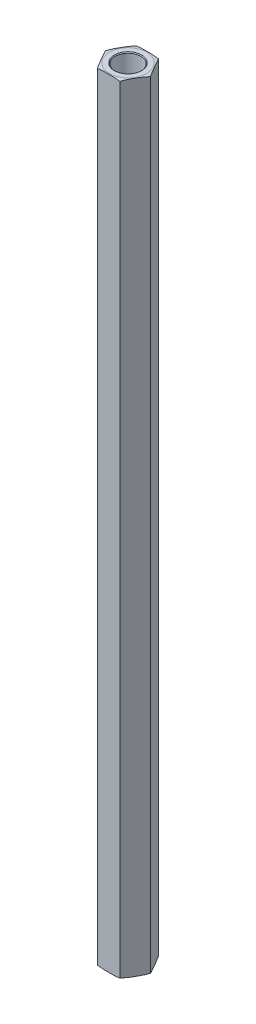
ISO-10303-21;
HEADER;
FILE_DESCRIPTION(('STEP AP214'),'2;1');
FILE_NAME('part.step','',(''),(''),'','','');
FILE_SCHEMA(('AUTOMOTIVE_DESIGN { 1 0 10303 214 1 1 1 1 }'));
ENDSEC;
DATA;
#1=APPLICATION_CONTEXT('core data for automotive mechanical design processes');
#2=APPLICATION_PROTOCOL_DEFINITION('international standard','automotive_design',2000,#1);
#3=PRODUCT_CONTEXT('',#1,'mechanical');
#4=PRODUCT('Part','Part','',(#3));
#5=PRODUCT_RELATED_PRODUCT_CATEGORY('part','',(#4));
#6=PRODUCT_DEFINITION_FORMATION('','',#4);
#7=PRODUCT_DEFINITION_CONTEXT('part definition',#1,'design');
#8=PRODUCT_DEFINITION('design','',#6,#7);
#9=PRODUCT_DEFINITION_SHAPE('','',#8);
#10=(LENGTH_UNIT() NAMED_UNIT(*) SI_UNIT(.MILLI.,.METRE.));
#11=(NAMED_UNIT(*) PLANE_ANGLE_UNIT() SI_UNIT($,.RADIAN.));
#12=(NAMED_UNIT(*) SI_UNIT($,.STERADIAN.) SOLID_ANGLE_UNIT());
#13=UNCERTAINTY_MEASURE_WITH_UNIT(LENGTH_MEASURE(1.E-05),#10,'distance_accuracy_value','');
#14=(GEOMETRIC_REPRESENTATION_CONTEXT(3) GLOBAL_UNCERTAINTY_ASSIGNED_CONTEXT((#13)) GLOBAL_UNIT_ASSIGNED_CONTEXT((#10,
#11,#12)) REPRESENTATION_CONTEXT('',''));
#15=CARTESIAN_POINT('',(0.,0.,0.));
#16=DIRECTION('',(0.,0.,1.));
#17=DIRECTION('',(1.,0.,0.));
#18=AXIS2_PLACEMENT_3D('',#15,#16,#17);
#19=CARTESIAN_POINT('',(0.,50.8,0.));
#20=DIRECTION('',(0.,1.,0.));
#21=DIRECTION('',(0.,0.,1.));
#22=AXIS2_PLACEMENT_3D('',#19,#20,#21);
#23=PLANE('',#22);
#24=CARTESIAN_POINT('',(0.,50.8,0.));
#25=DIRECTION('',(0.,1.,0.));
#26=DIRECTION('',(0.,0.,1.));
#27=AXIS2_PLACEMENT_3D('',#24,#25,#26);
#28=CIRCLE('',#27,2.0955);
#29=CARTESIAN_POINT('',(0.,50.8,2.0955));
#30=VERTEX_POINT('',#29);
#31=EDGE_CURVE('E316',#30,#30,#28,.T.);
#32=ORIENTED_EDGE('',*,*,#31,.T.);
#33=EDGE_LOOP('',(#32));
#34=FACE_BOUND('',#33,.T.);
#35=ADVANCED_FACE('F18',(#34),#23,.T.);
#36=CARTESIAN_POINT('',(0.,-50.8,0.));
#37=DIRECTION('',(0.,-1.,0.));
#38=DIRECTION('',(0.,0.,-1.));
#39=AXIS2_PLACEMENT_3D('',#36,#37,#38);
#40=PLANE('',#39);
#41=CARTESIAN_POINT('',(0.,-50.8,0.));
#42=DIRECTION('',(0.,-1.,0.));
#43=DIRECTION('',(0.,0.,-1.));
#44=AXIS2_PLACEMENT_3D('',#41,#42,#43);
#45=CIRCLE('',#44,2.0955);
#46=CARTESIAN_POINT('',(0.,-50.8,-2.0955));
#47=VERTEX_POINT('',#46);
#48=EDGE_CURVE('E450',#47,#47,#45,.T.);
#49=ORIENTED_EDGE('',*,*,#48,.T.);
#50=EDGE_LOOP('',(#49));
#51=FACE_BOUND('',#50,.T.);
#52=ADVANCED_FACE('F421',(#51),#40,.T.);
#53=CARTESIAN_POINT('',(0.,50.8,0.));
#54=DIRECTION('',(0.,1.,0.));
#55=DIRECTION('',(0.,0.,1.));
#56=AXIS2_PLACEMENT_3D('',#53,#54,#55);
#57=CYLINDRICAL_SURFACE('',#56,2.0955);
#58=CARTESIAN_POINT('',(0.,63.3729999999559,0.));
#59=DIRECTION('',(0.,1.,0.));
#60=DIRECTION('',(0.,0.,1.));
#61=AXIS2_PLACEMENT_3D('',#58,#59,#60);
#62=CIRCLE('',#61,2.09549999993897);
#63=CARTESIAN_POINT('',(0.,63.3729999999559,2.09549999993897));
#64=VERTEX_POINT('',#63);
#65=EDGE_CURVE('E452',#64,#64,#62,.T.);
#66=ORIENTED_EDGE('',*,*,#65,.T.);
#67=EDGE_LOOP('',(#66));
#68=FACE_BOUND('',#67,.T.);
#69=ORIENTED_EDGE('',*,*,#31,.F.);
#70=EDGE_LOOP('',(#69));
#71=FACE_BOUND('',#70,.T.);
#72=ADVANCED_FACE('F411',(#68,#71),#57,.F.);
#73=CARTESIAN_POINT('',(0.,-50.8,0.));
#74=DIRECTION('',(0.,-1.,0.));
#75=DIRECTION('',(0.,0.,-1.));
#76=AXIS2_PLACEMENT_3D('',#73,#74,#75);
#77=CYLINDRICAL_SURFACE('',#76,2.0955);
#78=ORIENTED_EDGE('',*,*,#48,.F.);
#79=EDGE_LOOP('',(#78));
#80=FACE_BOUND('',#79,.T.);
#81=CARTESIAN_POINT('',(0.,-63.3730000000128,0.));
#82=DIRECTION('',(0.,-1.,0.));
#83=DIRECTION('',(0.,0.,-1.));
#84=AXIS2_PLACEMENT_3D('',#81,#82,#83);
#85=CIRCLE('',#84,2.09550000005265);
#86=CARTESIAN_POINT('',(0.,-63.3730000000128,-2.09550000005265));
#87=VERTEX_POINT('',#86);
#88=EDGE_CURVE('E160',#87,#87,#85,.T.);
#89=ORIENTED_EDGE('',*,*,#88,.T.);
#90=EDGE_LOOP('',(#89));
#91=FACE_BOUND('',#90,.T.);
#92=ADVANCED_FACE('F401',(#80,#91),#77,.F.);
#93=CARTESIAN_POINT('',(0.,63.4999999999764,0.));
#94=DIRECTION('',(0.,1.,0.));
#95=DIRECTION('',(0.,0.,1.));
#96=AXIS2_PLACEMENT_3D('',#93,#94,#95);
#97=CONICAL_SURFACE('',#96,2.22249999995938,0.785398163397448);
#98=CARTESIAN_POINT('',(0.,63.5000000000332,0.));
#99=DIRECTION('',(0.,1.,0.));
#100=DIRECTION('',(0.,0.,1.));
#101=AXIS2_PLACEMENT_3D('',#98,#99,#100);
#102=CIRCLE('',#101,2.22250000001623);
#103=CARTESIAN_POINT('',(0.,63.5000000000332,2.22250000001623));
#104=VERTEX_POINT('',#103);
#105=EDGE_CURVE('E313',#104,#104,#102,.T.);
#106=ORIENTED_EDGE('',*,*,#105,.T.);
#107=EDGE_LOOP('',(#106));
#108=FACE_BOUND('',#107,.T.);
#109=ORIENTED_EDGE('',*,*,#65,.F.);
#110=EDGE_LOOP('',(#109));
#111=FACE_BOUND('',#110,.T.);
#112=ADVANCED_FACE('F336',(#108,#111),#97,.F.);
#113=CARTESIAN_POINT('',(3.66617420935412,63.5,0.));
#114=DIRECTION('',(-0.866025403784439,0.,0.5));
#115=DIRECTION('',(0.5,0.,0.866025403784439));
#116=AXIS2_PLACEMENT_3D('',#113,#114,#115);
#117=PLANE('',#116);
#118=DIRECTION('',(0.,1.,0.));
#119=VECTOR('',#118,1.);
#120=CARTESIAN_POINT('',(1.83308710467706,63.5,-3.175));
#121=LINE('',#120,#119);
#122=CARTESIAN_POINT('',(1.83308710467706,-63.373,-3.175));
#123=VERTEX_POINT('',#122);
#124=CARTESIAN_POINT('',(1.83308710467706,63.373,-3.175));
#125=VERTEX_POINT('',#124);
#126=EDGE_CURVE('E80',#123,#125,#121,.T.);
#127=ORIENTED_EDGE('',*,*,#126,.T.);
#128=CARTESIAN_POINT('',(3.66617420935412,63.373,0.));
#129=CARTESIAN_POINT('',(3.62797961467394,63.3889014148997,-0.0661549785605575));
#130=CARTESIAN_POINT('',(3.58956810864157,63.4024886076105,-0.132685658603875));
#131=CARTESIAN_POINT('',(3.51249051795711,63.4258161979402,-0.266187961794358));
#132=CARTESIAN_POINT('',(3.47382473049846,63.4355604771397,-0.333159070187389));
#133=CARTESIAN_POINT('',(3.39641631867873,63.4519966530451,-0.46723437239238));
#134=CARTESIAN_POINT('',(3.35767399633312,63.4586945328669,-0.534338043098183));
#135=CARTESIAN_POINT('',(3.28009834620113,63.4697767572932,-0.66870301055698));
#136=CARTESIAN_POINT('',(3.24126499587771,63.474160450474,-0.735964346345267));
#137=CARTESIAN_POINT('',(3.16354065964315,63.4812403004263,-0.870586845688097));
#138=CARTESIAN_POINT('',(3.12464965374476,63.4839355237591,-0.937948043861568));
#139=CARTESIAN_POINT('',(3.04685144594593,63.4881531983714,-1.07269849250694));
#140=CARTESIAN_POINT('',(3.00794424351969,63.4896756080272,-1.14008774388955));
#141=CARTESIAN_POINT('',(2.93051517598873,63.491922705889,-1.27419882283586));
#142=CARTESIAN_POINT('',(2.89199336248934,63.4926552468181,-1.34092056101649));
#143=CARTESIAN_POINT('',(2.81494778346144,63.4935767302574,-1.47436741839139));
#144=CARTESIAN_POINT('',(2.77642401791439,63.4937656658949,-1.54109253761774));
#145=CARTESIAN_POINT('',(2.69935964431012,63.4936659966806,-1.6745719481538));
#146=CARTESIAN_POINT('',(2.66081903631821,63.4933771811766,-1.74132623935039));
#147=CARTESIAN_POINT('',(2.5837390808533,63.492221986219,-1.87483263846077));
#148=CARTESIAN_POINT('',(2.54519973341245,63.4913555970386,-1.94158474631886));
#149=CARTESIAN_POINT('',(2.46812969629771,63.4887861940656,-2.07507396634282));
#150=CARTESIAN_POINT('',(2.42959900625965,63.4870832271616,-2.14181107913942));
#151=CARTESIAN_POINT('',(2.35255651340908,63.4824387229726,-2.27525259109836));
#152=CARTESIAN_POINT('',(2.31404470975443,63.4794972471358,-2.34195699171935));
#153=CARTESIAN_POINT('',(2.25084206239945,63.4732174124749,-2.45142718811103));
#154=CARTESIAN_POINT('',(2.2261384933701,63.4703980110463,-2.49421502479815));
#155=CARTESIAN_POINT('',(2.17676945272228,63.4638696794304,-2.57972471152111));
#156=CARTESIAN_POINT('',(2.15210397034183,63.4601610809139,-2.62244658019723));
#157=CARTESIAN_POINT('',(2.10282753811696,63.4516802711497,-2.70779586442644));
#158=CARTESIAN_POINT('',(2.07821657107529,63.4469084657008,-2.75042330976602));
#159=CARTESIAN_POINT('',(2.02900094683549,63.4360987712516,-2.83566727147556));
#160=CARTESIAN_POINT('',(2.00439646085463,63.4300577313084,-2.87828349128853));
#161=CARTESIAN_POINT('',(1.95527325900933,63.4165138354161,-2.96336737271505));
#162=CARTESIAN_POINT('',(1.93075459617614,63.409010197803,-3.00583494247579));
#163=CARTESIAN_POINT('',(1.88182157373171,63.3923203507084,-3.09058942351745));
#164=CARTESIAN_POINT('',(1.85740744053269,63.3831314978033,-3.1328759426409));
#165=CARTESIAN_POINT('',(1.83308710467706,63.373,-3.175));
#166=B_SPLINE_CURVE_WITH_KNOTS('',3,(#128,#129,#130,#131,#132,#133,#134,#135,#136,#137,#138,
#139,#140,#141,#142,#143,#144,#145,#146,#147,#148,#149,#150,#151,#152,#153,#154,#155,#156,#157,
#158,#159,#160,#161,#162,#163,#164,#165),.UNSPECIFIED.,.F.,.F.,(4,2,2,2,2,2,2,2,2,2,2,2,2,2,2,2,
2,2,4),(0.,0.233977307817942,0.467717675040691,0.700996973557496,0.934341903229746,
1.16781571967239,1.40129782179824,1.63243665809669,1.86357841666616,2.09482211846293,
2.32606971471494,2.55730435147396,2.78852751694412,2.93698369265086,3.08538458004473,
3.23372892334584,3.38244598546612,3.53124274626084,3.68027493713585),.UNSPECIFIED.);
#167=CARTESIAN_POINT('',(3.66617420935412,63.373,0.));
#168=VERTEX_POINT('',#167);
#169=EDGE_CURVE('E73',#168,#125,#166,.T.);
#170=ORIENTED_EDGE('',*,*,#169,.F.);
#171=DIRECTION('',(0.,1.,0.));
#172=VECTOR('',#171,1.);
#173=CARTESIAN_POINT('',(3.66617420935412,63.5,0.));
#174=LINE('',#173,#172);
#175=CARTESIAN_POINT('',(3.66617420935412,-63.373,0.));
#176=VERTEX_POINT('',#175);
#177=EDGE_CURVE('E77',#168,#176,#174,.F.);
#178=ORIENTED_EDGE('',*,*,#177,.T.);
#179=CARTESIAN_POINT('',(1.83308710467706,-63.373,-3.17499999999999));
#180=CARTESIAN_POINT('',(1.87128169935724,-63.3889014148997,-3.10884502143943));
#181=CARTESIAN_POINT('',(1.90969320538961,-63.4024886076105,-3.04231434139611));
#182=CARTESIAN_POINT('',(1.98677079607407,-63.4258161979402,-2.90881203820563));
#183=CARTESIAN_POINT('',(2.02543658353272,-63.4355604771397,-2.8418409298126));
#184=CARTESIAN_POINT('',(2.10284499535245,-63.4519966530451,-2.70776562760761));
#185=CARTESIAN_POINT('',(2.14158731769806,-63.4586945328669,-2.6406619569018));
#186=CARTESIAN_POINT('',(2.21916296783005,-63.4697767572932,-2.50629698944301));
#187=CARTESIAN_POINT('',(2.25799631815347,-63.474160450474,-2.43903565365472));
#188=CARTESIAN_POINT('',(2.33572065438804,-63.4812403004263,-2.30441315431189));
#189=CARTESIAN_POINT('',(2.37461166028642,-63.4839355237591,-2.23705195613842));
#190=CARTESIAN_POINT('',(2.45240986808526,-63.4881531983714,-2.10230150749304));
#191=CARTESIAN_POINT('',(2.49131707051149,-63.4896756080272,-2.03491225611043));
#192=CARTESIAN_POINT('',(2.56874613804245,-63.491922705889,-1.90080117716413));
#193=CARTESIAN_POINT('',(2.60726795154184,-63.4926552468181,-1.8340794389835));
#194=CARTESIAN_POINT('',(2.68431353056975,-63.4935767302574,-1.70063258160859));
#195=CARTESIAN_POINT('',(2.72283729611679,-63.4937656658949,-1.63390746238224));
#196=CARTESIAN_POINT('',(2.79990166972106,-63.4936659966806,-1.50042805184618));
#197=CARTESIAN_POINT('',(2.83844227771297,-63.4933771811766,-1.4336737606496));
#198=CARTESIAN_POINT('',(2.91552223317789,-63.492221986219,-1.30016736153921));
#199=CARTESIAN_POINT('',(2.95406158061873,-63.4913555970386,-1.23341525368112));
#200=CARTESIAN_POINT('',(3.03113161773348,-63.4887861940656,-1.09992603365716));
#201=CARTESIAN_POINT('',(3.06966230777154,-63.4870832271616,-1.03318892086056));
#202=CARTESIAN_POINT('',(3.1467048006221,-63.4824387229726,-0.899747408901616));
#203=CARTESIAN_POINT('',(3.18521660427676,-63.4794972471358,-0.833043008280631));
#204=CARTESIAN_POINT('',(3.24841925163174,-63.4732174124749,-0.723572811888948));
#205=CARTESIAN_POINT('',(3.27312282066109,-63.4703980110463,-0.680784975201834));
#206=CARTESIAN_POINT('',(3.32249186130891,-63.4638696794304,-0.595275288478877));
#207=CARTESIAN_POINT('',(3.34715734368935,-63.4601610809139,-0.552553419802754));
#208=CARTESIAN_POINT('',(3.39643377591422,-63.4516802711497,-0.467204135573548));
#209=CARTESIAN_POINT('',(3.42104474295589,-63.4469084657008,-0.424576690233975));
#210=CARTESIAN_POINT('',(3.47026036719568,-63.4360987712516,-0.339332728524437));
#211=CARTESIAN_POINT('',(3.49486485317655,-63.4300577313084,-0.296716508711467));
#212=CARTESIAN_POINT('',(3.54398805502185,-63.4165138354161,-0.211632627284948));
#213=CARTESIAN_POINT('',(3.56850671785504,-63.409010197803,-0.169165057524209));
#214=CARTESIAN_POINT('',(3.61743974029946,-63.3923203507084,-0.0844105764825525));
#215=CARTESIAN_POINT('',(3.64185387349848,-63.3831314978033,-0.0421240573591055));
#216=CARTESIAN_POINT('',(3.66617420935411,-63.373,0.));
#217=B_SPLINE_CURVE_WITH_KNOTS('',3,(#179,#180,#181,#182,#183,#184,#185,#186,#187,#188,#189,
#190,#191,#192,#193,#194,#195,#196,#197,#198,#199,#200,#201,#202,#203,#204,#205,#206,#207,#208,
#209,#210,#211,#212,#213,#214,#215,#216),.UNSPECIFIED.,.F.,.F.,(4,2,2,2,2,2,2,2,2,2,2,2,2,2,2,2,
2,2,4),(0.,0.233977307817943,0.467717675040694,0.7009969735575,0.934341903229751,
1.1678157196724,1.40129782179824,1.6324366580967,1.86357841666617,2.09482211846294,
2.32606971471495,2.55730435147398,2.78852751694413,2.93698369265087,3.08538458004473,
3.23372892334584,3.38244598546612,3.53124274626083,3.68027493713583),.UNSPECIFIED.);
#218=EDGE_CURVE('E91',#123,#176,#217,.T.);
#219=ORIENTED_EDGE('',*,*,#218,.F.);
#220=EDGE_LOOP('',(#127,#170,#178,#219));
#221=FACE_BOUND('',#220,.T.);
#222=ADVANCED_FACE('F75',(#221),#117,.F.);
#223=CARTESIAN_POINT('',(0.,-63.4999999999195,0.));
#224=DIRECTION('',(0.,-1.,0.));
#225=DIRECTION('',(0.,0.,-1.));
#226=AXIS2_PLACEMENT_3D('',#223,#224,#225);
#227=CONICAL_SURFACE('',#226,2.22249999995938,0.785398163397448);
#228=ORIENTED_EDGE('',*,*,#88,.F.);
#229=EDGE_LOOP('',(#228));
#230=FACE_BOUND('',#229,.T.);
#231=CARTESIAN_POINT('',(0.,-63.4999999999764,0.));
#232=DIRECTION('',(0.,-1.,0.));
#233=DIRECTION('',(0.,0.,-1.));
#234=AXIS2_PLACEMENT_3D('',#231,#232,#233);
#235=CIRCLE('',#234,2.22250000001623);
#236=CARTESIAN_POINT('',(0.,-63.4999999999764,-2.22250000001623));
#237=VERTEX_POINT('',#236);
#238=EDGE_CURVE('E292',#237,#237,#235,.F.);
#239=ORIENTED_EDGE('',*,*,#238,.F.);
#240=EDGE_LOOP('',(#239));
#241=FACE_BOUND('',#240,.T.);
#242=ADVANCED_FACE('F328',(#230,#241),#227,.F.);
#243=CARTESIAN_POINT('',(-1.83308710467707,63.5,-3.175));
#244=DIRECTION('',(0.,-1.,0.));
#245=DIRECTION('',(0.,0.,-1.));
#246=AXIS2_PLACEMENT_3D('',#243,#244,#245);
#247=PLANE('',#246);
#248=CARTESIAN_POINT('',(0.,63.5,0.));
#249=DIRECTION('',(0.,-1.,0.));
#250=DIRECTION('',(0.,0.,1.));
#251=AXIS2_PLACEMENT_3D('',#248,#249,#250);
#252=CIRCLE('',#251,3.03117420935412);
#253=CARTESIAN_POINT('',(0.,63.5,3.03117420935412));
#254=VERTEX_POINT('',#253);
#255=CARTESIAN_POINT('',(0.,63.5,-3.03117420935412));
#256=VERTEX_POINT('',#255);
#257=EDGE_CURVE('E136',#254,#256,#252,.T.);
#258=ORIENTED_EDGE('',*,*,#257,.F.);
#259=CARTESIAN_POINT('',(0.,63.5,0.));
#260=DIRECTION('',(0.,-1.,0.));
#261=DIRECTION('',(0.,0.,-1.));
#262=AXIS2_PLACEMENT_3D('',#259,#260,#261);
#263=CIRCLE('',#262,3.03117420935412);
#264=EDGE_CURVE('E84',#256,#254,#263,.T.);
#265=ORIENTED_EDGE('',*,*,#264,.F.);
#266=EDGE_LOOP('',(#258,#265));
#267=FACE_BOUND('',#266,.T.);
#268=ORIENTED_EDGE('',*,*,#105,.F.);
#269=EDGE_LOOP('',(#268));
#270=FACE_BOUND('',#269,.T.);
#271=ADVANCED_FACE('F122',(#267,#270),#247,.F.);
#272=CARTESIAN_POINT('',(1.83308710467706,63.5,3.17499999999999));
#273=DIRECTION('',(-0.866025403784439,0.,-0.5));
#274=DIRECTION('',(-0.5,0.,0.866025403784439));
#275=AXIS2_PLACEMENT_3D('',#272,#273,#274);
#276=PLANE('',#275);
#277=ORIENTED_EDGE('',*,*,#177,.F.);
#278=CARTESIAN_POINT('',(1.83308710467706,63.373,3.17499999999999));
#279=CARTESIAN_POINT('',(1.87128169935724,63.3889014148997,3.10884502143944));
#280=CARTESIAN_POINT('',(1.90969320538961,63.4024886076105,3.04231434139612));
#281=CARTESIAN_POINT('',(1.98677079607407,63.4258161979402,2.90881203820563));
#282=CARTESIAN_POINT('',(2.02543658353272,63.4355604771397,2.8418409298126));
#283=CARTESIAN_POINT('',(2.10284499535245,63.4519966530451,2.70776562760761));
#284=CARTESIAN_POINT('',(2.14158731769806,63.4586945328669,2.64066195690181));
#285=CARTESIAN_POINT('',(2.21916296783005,63.4697767572932,2.50629698944301));
#286=CARTESIAN_POINT('',(2.25799631815347,63.474160450474,2.43903565365473));
#287=CARTESIAN_POINT('',(2.33572065438803,63.4812403004263,2.3044131543119));
#288=CARTESIAN_POINT('',(2.37461166028642,63.4839355237591,2.23705195613843));
#289=CARTESIAN_POINT('',(2.45240986808525,63.4881531983714,2.10230150749305));
#290=CARTESIAN_POINT('',(2.49131707051149,63.4896756080272,2.03491225611044));
#291=CARTESIAN_POINT('',(2.56874613804245,63.491922705889,1.90080117716414));
#292=CARTESIAN_POINT('',(2.60726795154184,63.4926552468181,1.83407943898351));
#293=CARTESIAN_POINT('',(2.68431353056974,63.4935767302574,1.7006325816086));
#294=CARTESIAN_POINT('',(2.72283729611679,63.4937656658949,1.63390746238225));
#295=CARTESIAN_POINT('',(2.79990166972106,63.4936659966806,1.50042805184619));
#296=CARTESIAN_POINT('',(2.83844227771297,63.4933771811766,1.43367376064961));
#297=CARTESIAN_POINT('',(2.91552223317788,63.492221986219,1.30016736153923));
#298=CARTESIAN_POINT('',(2.95406158061873,63.4913555970386,1.23341525368113));
#299=CARTESIAN_POINT('',(3.03113161773347,63.4887861940656,1.09992603365717));
#300=CARTESIAN_POINT('',(3.06966230777153,63.4870832271616,1.03318892086057));
#301=CARTESIAN_POINT('',(3.1467048006221,63.4824387229726,0.89974740890163));
#302=CARTESIAN_POINT('',(3.18521660427676,63.4794972471358,0.833043008280645));
#303=CARTESIAN_POINT('',(3.24841925163173,63.4732174124749,0.723572811888962));
#304=CARTESIAN_POINT('',(3.27312282066108,63.4703980110463,0.680784975201847));
#305=CARTESIAN_POINT('',(3.3224918613089,63.4638696794304,0.595275288478887));
#306=CARTESIAN_POINT('',(3.34715734368935,63.4601610809139,0.552553419802764));
#307=CARTESIAN_POINT('',(3.39643377591422,63.4516802711497,0.467204135573556));
#308=CARTESIAN_POINT('',(3.42104474295589,63.4469084657008,0.424576690233982));
#309=CARTESIAN_POINT('',(3.47026036719568,63.4360987712516,0.339332728524442));
#310=CARTESIAN_POINT('',(3.49486485317655,63.4300577313084,0.296716508711471));
#311=CARTESIAN_POINT('',(3.54398805502185,63.4165138354161,0.211632627284951));
#312=CARTESIAN_POINT('',(3.56850671785504,63.409010197803,0.169165057524211));
#313=CARTESIAN_POINT('',(3.61743974029947,63.3923203507084,0.0844105764825526));
#314=CARTESIAN_POINT('',(3.64185387349848,63.3831314978033,0.0421240573591046));
#315=CARTESIAN_POINT('',(3.66617420935412,63.373,0.));
#316=B_SPLINE_CURVE_WITH_KNOTS('',3,(#278,#279,#280,#281,#282,#283,#284,#285,#286,#287,#288,
#289,#290,#291,#292,#293,#294,#295,#296,#297,#298,#299,#300,#301,#302,#303,#304,#305,#306,#307,
#308,#309,#310,#311,#312,#313,#314,#315),.UNSPECIFIED.,.F.,.F.,(4,2,2,2,2,2,2,2,2,2,2,2,2,2,2,2,
2,2,4),(0.,0.233977307817942,0.467717675040691,0.700996973557496,0.934341903229745,
1.16781571967239,1.40129782179824,1.63243665809669,1.86357841666616,2.09482211846293,
2.32606971471494,2.55730435147396,2.78852751694412,2.93698369265086,3.08538458004472,
3.23372892334583,3.38244598546612,3.53124274626083,3.68027493713584),.UNSPECIFIED.);
#317=CARTESIAN_POINT('',(1.83308710467706,63.373,3.17499999999999));
#318=VERTEX_POINT('',#317);
#319=EDGE_CURVE('E83',#318,#168,#316,.T.);
#320=ORIENTED_EDGE('',*,*,#319,.F.);
#321=DIRECTION('',(0.,1.,0.));
#322=VECTOR('',#321,1.);
#323=CARTESIAN_POINT('',(1.83308710467706,63.5,3.17499999999999));
#324=LINE('',#323,#322);
#325=CARTESIAN_POINT('',(1.83308710467706,-63.373,3.17499999999999));
#326=VERTEX_POINT('',#325);
#327=EDGE_CURVE('E183',#318,#326,#324,.F.);
#328=ORIENTED_EDGE('',*,*,#327,.T.);
#329=CARTESIAN_POINT('',(3.66617420935412,-63.373,0.));
#330=CARTESIAN_POINT('',(3.62797961467394,-63.3889014148997,0.0661549785605648));
#331=CARTESIAN_POINT('',(3.58956810864156,-63.4024886076105,0.132685658603882));
#332=CARTESIAN_POINT('',(3.5124905179571,-63.4258161979402,0.266187961794366));
#333=CARTESIAN_POINT('',(3.47382473049846,-63.4355604771397,0.333159070187397));
#334=CARTESIAN_POINT('',(3.39641631867873,-63.4519966530451,0.467234372392389));
#335=CARTESIAN_POINT('',(3.35767399633312,-63.4586945328669,0.534338043098192));
#336=CARTESIAN_POINT('',(3.28009834620113,-63.4697767572932,0.668703010556991));
#337=CARTESIAN_POINT('',(3.24126499587771,-63.474160450474,0.735964346345278));
#338=CARTESIAN_POINT('',(3.16354065964314,-63.4812403004263,0.870586845688109));
#339=CARTESIAN_POINT('',(3.12464965374475,-63.4839355237591,0.93794804386158));
#340=CARTESIAN_POINT('',(3.04685144594592,-63.4881531983714,1.07269849250696));
#341=CARTESIAN_POINT('',(3.00794424351969,-63.4896756080272,1.14008774388956));
#342=CARTESIAN_POINT('',(2.93051517598872,-63.491922705889,1.27419882283587));
#343=CARTESIAN_POINT('',(2.89199336248934,-63.4926552468181,1.3409205610165));
#344=CARTESIAN_POINT('',(2.81494778346143,-63.4935767302574,1.47436741839141));
#345=CARTESIAN_POINT('',(2.77642401791438,-63.4937656658949,1.54109253761776));
#346=CARTESIAN_POINT('',(2.69935964431012,-63.4936659966806,1.67457194815382));
#347=CARTESIAN_POINT('',(2.66081903631821,-63.4933771811766,1.7413262393504));
#348=CARTESIAN_POINT('',(2.58373908085329,-63.492221986219,1.87483263846079));
#349=CARTESIAN_POINT('',(2.54519973341244,-63.4913555970386,1.94158474631888));
#350=CARTESIAN_POINT('',(2.4681296962977,-63.4887861940656,2.07507396634284));
#351=CARTESIAN_POINT('',(2.42959900625964,-63.4870832271616,2.14181107913944));
#352=CARTESIAN_POINT('',(2.35255651340907,-63.4824387229726,2.27525259109838));
#353=CARTESIAN_POINT('',(2.31404470975442,-63.4794972471358,2.34195699171937));
#354=CARTESIAN_POINT('',(2.25084206239944,-63.4732174124749,2.45142718811105));
#355=CARTESIAN_POINT('',(2.22613849337009,-63.4703980110463,2.49421502479817));
#356=CARTESIAN_POINT('',(2.17676945272227,-63.4638696794304,2.57972471152112));
#357=CARTESIAN_POINT('',(2.15210397034183,-63.4601610809139,2.62244658019725));
#358=CARTESIAN_POINT('',(2.10282753811695,-63.4516802711497,2.70779586442645));
#359=CARTESIAN_POINT('',(2.07821657107529,-63.4469084657008,2.75042330976602));
#360=CARTESIAN_POINT('',(2.02900094683549,-63.4360987712516,2.83566727147556));
#361=CARTESIAN_POINT('',(2.00439646085463,-63.4300577313084,2.87828349128853));
#362=CARTESIAN_POINT('',(1.95527325900933,-63.4165138354161,2.96336737271505));
#363=CARTESIAN_POINT('',(1.93075459617614,-63.409010197803,3.00583494247579));
#364=CARTESIAN_POINT('',(1.88182157373171,-63.3923203507084,3.09058942351744));
#365=CARTESIAN_POINT('',(1.8574074405327,-63.3831314978033,3.13287594264089));
#366=CARTESIAN_POINT('',(1.83308710467706,-63.373,3.17499999999999));
#367=B_SPLINE_CURVE_WITH_KNOTS('',3,(#329,#330,#331,#332,#333,#334,#335,#336,#337,#338,#339,
#340,#341,#342,#343,#344,#345,#346,#347,#348,#349,#350,#351,#352,#353,#354,#355,#356,#357,#358,
#359,#360,#361,#362,#363,#364,#365,#366),.UNSPECIFIED.,.F.,.F.,(4,2,2,2,2,2,2,2,2,2,2,2,2,2,2,2,
2,2,4),(0.,0.233977307817943,0.467717675040693,0.7009969735575,0.934341903229751,
1.1678157196724,1.40129782179825,1.6324366580967,1.86357841666617,2.09482211846294,
2.32606971471495,2.55730435147398,2.78852751694413,2.93698369265087,3.08538458004473,
3.23372892334584,3.38244598546612,3.53124274626083,3.68027493713583),.UNSPECIFIED.);
#368=EDGE_CURVE('E90',#176,#326,#367,.T.);
#369=ORIENTED_EDGE('',*,*,#368,.F.);
#370=EDGE_LOOP('',(#277,#320,#328,#369));
#371=FACE_BOUND('',#370,.T.);
#372=ADVANCED_FACE('F87',(#371),#276,.F.);
#373=CARTESIAN_POINT('',(1.83308710467706,63.5,-3.175));
#374=DIRECTION('',(0.,0.,1.));
#375=DIRECTION('',(1.,0.,0.));
#376=AXIS2_PLACEMENT_3D('',#373,#374,#375);
#377=PLANE('',#376);
#378=DIRECTION('',(0.,1.,0.));
#379=VECTOR('',#378,1.);
#380=CARTESIAN_POINT('',(-1.83308710467708,63.5,-3.17499999999998));
#381=LINE('',#380,#379);
#382=CARTESIAN_POINT('',(-1.83308710467708,-63.373,-3.17499999999998));
#383=VERTEX_POINT('',#382);
#384=CARTESIAN_POINT('',(-1.83308710467706,63.373,-3.17500000000001));
#385=VERTEX_POINT('',#384);
#386=EDGE_CURVE('E185',#383,#385,#381,.T.);
#387=ORIENTED_EDGE('',*,*,#386,.T.);
#388=CARTESIAN_POINT('',(1.83308710467706,63.373,-3.17500000000001));
#389=CARTESIAN_POINT('',(1.73237579828683,63.3939400141518,-3.175));
#390=CARTESIAN_POINT('',(1.63096506893486,63.4108853495327,-3.175));
#391=CARTESIAN_POINT('',(1.42767146651469,63.4384971643984,-3.175));
#392=CARTESIAN_POINT('',(1.32579191427254,63.4491875658753,-3.175));
#393=CARTESIAN_POINT('',(1.12177634709138,63.4661280408079,-3.175));
#394=CARTESIAN_POINT('',(1.0196405664338,63.4723812707189,-3.175));
#395=CARTESIAN_POINT('',(0.815663681397375,63.4819028064183,-3.175));
#396=CARTESIAN_POINT('',(0.713823115514573,63.4851834044999,-3.175));
#397=CARTESIAN_POINT('',(0.510018485441651,63.4899454848703,-3.175));
#398=CARTESIAN_POINT('',(0.408054390577976,63.4914254100882,-3.175));
#399=CARTESIAN_POINT('',(0.20406020033787,63.4933146818379,-3.175));
#400=CARTESIAN_POINT('',(0.102030100168935,63.4937234241492,-3.175));
#401=CARTESIAN_POINT('',(-0.102030100168934,63.4937234241492,-3.175));
#402=CARTESIAN_POINT('',(-0.204060200337869,63.4933146818379,-3.175));
#403=CARTESIAN_POINT('',(-0.408054390577975,63.4914254100882,-3.175));
#404=CARTESIAN_POINT('',(-0.510018485441649,63.4899454848703,-3.175));
#405=CARTESIAN_POINT('',(-0.713823115514571,63.4851834044999,-3.175));
#406=CARTESIAN_POINT('',(-0.815663681397373,63.4819028064183,-3.175));
#407=CARTESIAN_POINT('',(-1.01964056643379,63.4723812707189,-3.175));
#408=CARTESIAN_POINT('',(-1.12177634709137,63.4661280408079,-3.175));
#409=CARTESIAN_POINT('',(-1.32579191427254,63.4491875658753,-3.175));
#410=CARTESIAN_POINT('',(-1.42767146651469,63.4384971643984,-3.175));
#411=CARTESIAN_POINT('',(-1.63096506893485,63.4108853495327,-3.175));
#412=CARTESIAN_POINT('',(-1.73237579828683,63.3939400141518,-3.175));
#413=CARTESIAN_POINT('',(-1.83308710467705,63.373,-3.175));
#414=B_SPLINE_CURVE_WITH_KNOTS('',3,(#388,#389,#390,#391,#392,#393,#394,#395,#396,#397,#398,
#399,#400,#401,#402,#403,#404,#405,#406,#407,#408,#409,#410,#411,#412,#413),.UNSPECIFIED.,.F.,
.F.,(4,2,2,2,2,2,2,2,2,2,2,2,4),(0.,0.308333242342807,0.615479423308233,0.922406891130008,
1.2280592962085,1.53397581645216,1.84006485747889,2.14615389850561,2.45207041874927,
2.75772282382776,3.06465029164954,3.37179647261496,3.68012971495777),.UNSPECIFIED.);
#415=EDGE_CURVE('E188',#125,#385,#414,.T.);
#416=ORIENTED_EDGE('',*,*,#415,.F.);
#417=ORIENTED_EDGE('',*,*,#126,.F.);
#418=CARTESIAN_POINT('',(-1.83308710467707,-63.373,-3.175));
#419=CARTESIAN_POINT('',(-1.73237579828684,-63.3939400141518,-3.175));
#420=CARTESIAN_POINT('',(-1.63096506893487,-63.4108853495327,-3.175));
#421=CARTESIAN_POINT('',(-1.4276714665147,-63.4384971643984,-3.175));
#422=CARTESIAN_POINT('',(-1.32579191427255,-63.4491875658753,-3.175));
#423=CARTESIAN_POINT('',(-1.12177634709138,-63.4661280408079,-3.175));
#424=CARTESIAN_POINT('',(-1.0196405664338,-63.4723812707189,-3.175));
#425=CARTESIAN_POINT('',(-0.81566368139738,-63.4819028064183,-3.175));
#426=CARTESIAN_POINT('',(-0.713823115514577,-63.4851834044999,-3.175));
#427=CARTESIAN_POINT('',(-0.510018485441654,-63.4899454848703,-3.175));
#428=CARTESIAN_POINT('',(-0.408054390577979,-63.4914254100882,-3.175));
#429=CARTESIAN_POINT('',(-0.204060200337872,-63.4933146818379,-3.175));
#430=CARTESIAN_POINT('',(-0.102030100168936,-63.4937234241492,-3.175));
#431=CARTESIAN_POINT('',(0.102030100168935,-63.4937234241492,-3.175));
#432=CARTESIAN_POINT('',(0.20406020033787,-63.4933146818379,-3.175));
#433=CARTESIAN_POINT('',(0.408054390577976,-63.4914254100882,-3.175));
#434=CARTESIAN_POINT('',(0.510018485441651,-63.4899454848703,-3.175));
#435=CARTESIAN_POINT('',(0.713823115514573,-63.4851834044999,-3.175));
#436=CARTESIAN_POINT('',(0.815663681397375,-63.4819028064183,-3.175));
#437=CARTESIAN_POINT('',(1.0196405664338,-63.4723812707189,-3.175));
#438=CARTESIAN_POINT('',(1.12177634709137,-63.4661280408079,-3.175));
#439=CARTESIAN_POINT('',(1.32579191427254,-63.4491875658753,-3.175));
#440=CARTESIAN_POINT('',(1.42767146651469,-63.4384971643984,-3.175));
#441=CARTESIAN_POINT('',(1.63096506893486,-63.4108853495327,-3.175));
#442=CARTESIAN_POINT('',(1.73237579828683,-63.3939400141518,-3.175));
#443=CARTESIAN_POINT('',(1.83308710467706,-63.373,-3.17500000000001));
#444=B_SPLINE_CURVE_WITH_KNOTS('',3,(#418,#419,#420,#421,#422,#423,#424,#425,#426,#427,#428,
#429,#430,#431,#432,#433,#434,#435,#436,#437,#438,#439,#440,#441,#442,#443),.UNSPECIFIED.,.F.,
.F.,(4,2,2,2,2,2,2,2,2,2,2,2,4),(0.,0.308333242342808,0.615479423308236,0.922406891130012,
1.22805929620851,1.53397581645217,1.8400648574789,2.14615389850562,2.45207041874928,
2.75772282382777,3.06465029164955,3.37179647261498,3.68012971495778),.UNSPECIFIED.);
#445=EDGE_CURVE('E271',#383,#123,#444,.T.);
#446=ORIENTED_EDGE('',*,*,#445,.F.);
#447=EDGE_LOOP('',(#387,#416,#417,#446));
#448=FACE_BOUND('',#447,.T.);
#449=ADVANCED_FACE('F210',(#448),#377,.F.);
#450=CARTESIAN_POINT('',(-1.83308710467707,-63.5,-3.175));
#451=DIRECTION('',(0.,-1.,0.));
#452=DIRECTION('',(0.,0.,-1.));
#453=AXIS2_PLACEMENT_3D('',#450,#451,#452);
#454=PLANE('',#453);
#455=CARTESIAN_POINT('',(0.,-63.5,0.));
#456=DIRECTION('',(0.,1.,0.));
#457=DIRECTION('',(0.,0.,1.));
#458=AXIS2_PLACEMENT_3D('',#455,#456,#457);
#459=CIRCLE('',#458,3.03117420935412);
#460=CARTESIAN_POINT('',(0.,-63.5,-3.03117420935412));
#461=VERTEX_POINT('',#460);
#462=CARTESIAN_POINT('',(0.,-63.5,3.03117420935412));
#463=VERTEX_POINT('',#462);
#464=EDGE_CURVE('E189',#461,#463,#459,.F.);
#465=ORIENTED_EDGE('',*,*,#464,.T.);
#466=CARTESIAN_POINT('',(0.,-63.5,0.));
#467=DIRECTION('',(0.,1.,0.));
#468=DIRECTION('',(0.,0.,-1.));
#469=AXIS2_PLACEMENT_3D('',#466,#467,#468);
#470=CIRCLE('',#469,3.03117420935412);
#471=EDGE_CURVE('E223',#461,#463,#470,.T.);
#472=ORIENTED_EDGE('',*,*,#471,.F.);
#473=EDGE_LOOP('',(#465,#472));
#474=FACE_BOUND('',#473,.T.);
#475=ORIENTED_EDGE('',*,*,#238,.T.);
#476=EDGE_LOOP('',(#475));
#477=FACE_BOUND('',#476,.T.);
#478=ADVANCED_FACE('F201',(#474,#477),#454,.T.);
#479=CARTESIAN_POINT('',(-1.83308710467707,63.5,-3.175));
#480=DIRECTION('',(0.866025403784439,0.,0.5));
#481=DIRECTION('',(0.5,0.,-0.866025403784439));
#482=AXIS2_PLACEMENT_3D('',#479,#480,#481);
#483=PLANE('',#482);
#484=DIRECTION('',(0.,1.,0.));
#485=VECTOR('',#484,1.);
#486=CARTESIAN_POINT('',(-3.66617420935413,63.5,0.));
#487=LINE('',#486,#485);
#488=CARTESIAN_POINT('',(-3.66617420935412,-63.373,0.));
#489=VERTEX_POINT('',#488);
#490=CARTESIAN_POINT('',(-3.66617420935412,63.373,0.));
#491=VERTEX_POINT('',#490);
#492=EDGE_CURVE('E243',#489,#491,#487,.T.);
#493=ORIENTED_EDGE('',*,*,#492,.T.);
#494=CARTESIAN_POINT('',(-1.83308710467706,63.373,-3.17500000000001));
#495=CARTESIAN_POINT('',(-1.87128169935723,63.3889014148997,-3.10884502143945));
#496=CARTESIAN_POINT('',(-1.90969320538961,63.4024886076105,-3.04231434139614));
#497=CARTESIAN_POINT('',(-1.98677079607407,63.4258161979402,-2.90881203820566));
#498=CARTESIAN_POINT('',(-2.02543658353271,63.4355604771397,-2.84184092981263));
#499=CARTESIAN_POINT('',(-2.10284499535244,63.4519966530451,-2.70776562760765));
#500=CARTESIAN_POINT('',(-2.14158731769805,63.4586945328669,-2.64066195690185));
#501=CARTESIAN_POINT('',(-2.21916296783003,63.4697767572932,-2.50629698944305));
#502=CARTESIAN_POINT('',(-2.25799631815345,63.474160450474,-2.43903565365477));
#503=CARTESIAN_POINT('',(-2.33572065438801,63.4812403004263,-2.30441315431194));
#504=CARTESIAN_POINT('',(-2.3746116602864,63.4839355237591,-2.23705195613847));
#505=CARTESIAN_POINT('',(-2.45240986808523,63.4881531983714,-2.1023015074931));
#506=CARTESIAN_POINT('',(-2.49131707051147,63.4896756080272,-2.0349122561105));
#507=CARTESIAN_POINT('',(-2.56874613804243,63.491922705889,-1.90080117716419));
#508=CARTESIAN_POINT('',(-2.60726795154181,63.4926552468181,-1.83407943898356));
#509=CARTESIAN_POINT('',(-2.68431353056972,63.4935767302574,-1.70063258160867));
#510=CARTESIAN_POINT('',(-2.72283729611676,63.4937656658949,-1.63390746238232));
#511=CARTESIAN_POINT('',(-2.79990166972103,63.4936659966806,-1.50042805184626));
#512=CARTESIAN_POINT('',(-2.83844227771293,63.4933771811766,-1.43367376064968));
#513=CARTESIAN_POINT('',(-2.91552223317785,63.492221986219,-1.3001673615393));
#514=CARTESIAN_POINT('',(-2.95406158061869,63.4913555970386,-1.23341525368121));
#515=CARTESIAN_POINT('',(-3.03113161773343,63.4887861940656,-1.09992603365726));
#516=CARTESIAN_POINT('',(-3.06966230777149,63.4870832271616,-1.03318892086066));
#517=CARTESIAN_POINT('',(-3.14670480062205,63.4824387229726,-0.899747408901719));
#518=CARTESIAN_POINT('',(-3.18521660427671,63.4794972471358,-0.833043008280736));
#519=CARTESIAN_POINT('',(-3.24841925163169,63.4732174124749,-0.723572811889049));
#520=CARTESIAN_POINT('',(-3.27312282066104,63.4703980110463,-0.680784975201928));
#521=CARTESIAN_POINT('',(-3.32249186130887,63.4638696794304,-0.595275288478958));
#522=CARTESIAN_POINT('',(-3.34715734368932,63.4601610809139,-0.552553419802829));
#523=CARTESIAN_POINT('',(-3.3964337759142,63.4516802711497,-0.46720413557361));
#524=CARTESIAN_POINT('',(-3.42104474295587,63.4469084657009,-0.42457669023403));
#525=CARTESIAN_POINT('',(-3.47026036719567,63.4360987712516,-0.339332728524479));
#526=CARTESIAN_POINT('',(-3.49486485317654,63.4300577313084,-0.296716508711504));
#527=CARTESIAN_POINT('',(-3.54398805502184,63.4165138354161,-0.211632627284973));
#528=CARTESIAN_POINT('',(-3.56850671785504,63.409010197803,-0.169165057524227));
#529=CARTESIAN_POINT('',(-3.61743974029947,63.3923203507084,-0.0844105764825576));
#530=CARTESIAN_POINT('',(-3.64185387349849,63.3831314978033,-0.0421240573591044));
#531=CARTESIAN_POINT('',(-3.66617420935413,63.373,0.));
#532=B_SPLINE_CURVE_WITH_KNOTS('',3,(#494,#495,#496,#497,#498,#499,#500,#501,#502,#503,#504,
#505,#506,#507,#508,#509,#510,#511,#512,#513,#514,#515,#516,#517,#518,#519,#520,#521,#522,#523,
#524,#525,#526,#527,#528,#529,#530,#531),.UNSPECIFIED.,.F.,.F.,(4,2,2,2,2,2,2,2,2,2,2,2,2,2,2,2,
2,2,4),(0.,0.233977307817932,0.467717675040676,0.700996973557473,0.934341903229715,
1.16781571967235,1.40129782179819,1.63243665809664,1.8635784166661,2.09482211846287,
2.32606971471486,2.55730435147388,2.78852751694403,2.93698369265079,3.08538458004467,
3.2337289233458,3.3824459854661,3.53124274626084,3.68027493713587),.UNSPECIFIED.);
#533=EDGE_CURVE('E281',#385,#491,#532,.T.);
#534=ORIENTED_EDGE('',*,*,#533,.F.);
#535=ORIENTED_EDGE('',*,*,#386,.F.);
#536=CARTESIAN_POINT('',(-3.66617420935412,-63.373,0.));
#537=CARTESIAN_POINT('',(-3.62797961467395,-63.3889014148997,-0.0661549785605691));
#538=CARTESIAN_POINT('',(-3.58956810864157,-63.4024886076105,-0.132685658603886));
#539=CARTESIAN_POINT('',(-3.51249051795711,-63.4258161979402,-0.266187961794369));
#540=CARTESIAN_POINT('',(-3.47382473049847,-63.4355604771397,-0.3331590701874));
#541=CARTESIAN_POINT('',(-3.39641631867874,-63.4519966530451,-0.46723437239239));
#542=CARTESIAN_POINT('',(-3.35767399633313,-63.4586945328669,-0.534338043098193));
#543=CARTESIAN_POINT('',(-3.28009834620114,-63.4697767572932,-0.66870301055699));
#544=CARTESIAN_POINT('',(-3.24126499587772,-63.474160450474,-0.735964346345277));
#545=CARTESIAN_POINT('',(-3.16354065964315,-63.4812403004263,-0.870586845688106));
#546=CARTESIAN_POINT('',(-3.12464965374476,-63.4839355237591,-0.937948043861577));
#547=CARTESIAN_POINT('',(-3.04685144594593,-63.4881531983714,-1.07269849250695));
#548=CARTESIAN_POINT('',(-3.0079442435197,-63.4896756080272,-1.14008774388956));
#549=CARTESIAN_POINT('',(-2.93051517598874,-63.491922705889,-1.27419882283587));
#550=CARTESIAN_POINT('',(-2.89199336248935,-63.4926552468181,-1.3409205610165));
#551=CARTESIAN_POINT('',(-2.81494778346144,-63.4935767302574,-1.4743674183914));
#552=CARTESIAN_POINT('',(-2.7764240179144,-63.4937656658949,-1.54109253761775));
#553=CARTESIAN_POINT('',(-2.69935964431013,-63.4936659966806,-1.67457194815381));
#554=CARTESIAN_POINT('',(-2.66081903631822,-63.4933771811766,-1.7413262393504));
#555=CARTESIAN_POINT('',(-2.5837390808533,-63.492221986219,-1.87483263846078));
#556=CARTESIAN_POINT('',(-2.54519973341246,-63.4913555970386,-1.94158474631887));
#557=CARTESIAN_POINT('',(-2.46812969629771,-63.4887861940656,-2.07507396634283));
#558=CARTESIAN_POINT('',(-2.42959900625966,-63.4870832271616,-2.14181107913943));
#559=CARTESIAN_POINT('',(-2.35255651340909,-63.4824387229726,-2.27525259109837));
#560=CARTESIAN_POINT('',(-2.31404470975443,-63.4794972471358,-2.34195699171936));
#561=CARTESIAN_POINT('',(-2.25084206239946,-63.4732174124749,-2.45142718811104));
#562=CARTESIAN_POINT('',(-2.22613849337011,-63.4703980110463,-2.49421502479815));
#563=CARTESIAN_POINT('',(-2.17676945272229,-63.4638696794304,-2.57972471152111));
#564=CARTESIAN_POINT('',(-2.15210397034184,-63.4601610809139,-2.62244658019723));
#565=CARTESIAN_POINT('',(-2.10282753811697,-63.4516802711497,-2.70779586442644));
#566=CARTESIAN_POINT('',(-2.0782165710753,-63.4469084657008,-2.75042330976601));
#567=CARTESIAN_POINT('',(-2.02900094683551,-63.4360987712516,-2.83566727147555));
#568=CARTESIAN_POINT('',(-2.00439646085465,-63.4300577313084,-2.87828349128852));
#569=CARTESIAN_POINT('',(-1.95527325900935,-63.4165138354161,-2.96336737271504));
#570=CARTESIAN_POINT('',(-1.93075459617616,-63.409010197803,-3.00583494247578));
#571=CARTESIAN_POINT('',(-1.88182157373173,-63.3923203507084,-3.09058942351743));
#572=CARTESIAN_POINT('',(-1.85740744053272,-63.3831314978033,-3.13287594264088));
#573=CARTESIAN_POINT('',(-1.83308710467708,-63.373,-3.17499999999998));
#574=B_SPLINE_CURVE_WITH_KNOTS('',3,(#536,#537,#538,#539,#540,#541,#542,#543,#544,#545,#546,
#547,#548,#549,#550,#551,#552,#553,#554,#555,#556,#557,#558,#559,#560,#561,#562,#563,#564,#565,
#566,#567,#568,#569,#570,#571,#572,#573),.UNSPECIFIED.,.F.,.F.,(4,2,2,2,2,2,2,2,2,2,2,2,2,2,2,2,
2,2,4),(0.,0.233977307817941,0.46771767504069,0.700996973557493,0.934341903229743,
1.16781571967239,1.40129782179824,1.63243665809669,1.86357841666616,2.09482211846293,
2.32606971471493,2.55730435147396,2.78852751694411,2.93698369265085,3.08538458004471,
3.23372892334582,3.3824459854661,3.53124274626081,3.68027493713581),.UNSPECIFIED.);
#575=EDGE_CURVE('E247',#489,#383,#574,.T.);
#576=ORIENTED_EDGE('',*,*,#575,.F.);
#577=EDGE_LOOP('',(#493,#534,#535,#576));
#578=FACE_BOUND('',#577,.T.);
#579=ADVANCED_FACE('F173',(#578),#483,.F.);
#580=CARTESIAN_POINT('',(0.,61.849,0.));
#581=DIRECTION('',(0.,1.,0.));
#582=DIRECTION('',(0.,0.,1.));
#583=AXIS2_PLACEMENT_3D('',#580,#581,#582);
#584=TOROIDAL_SURFACE('',#583,3.03117420935412,1.65099999999997);
#585=ORIENTED_EDGE('',*,*,#169,.T.);
#586=ORIENTED_EDGE('',*,*,#415,.T.);
#587=ORIENTED_EDGE('',*,*,#533,.T.);
#588=CARTESIAN_POINT('',(-3.66617420935412,63.373,0.));
#589=CARTESIAN_POINT('',(-3.62797961467395,63.3889014148997,0.066154978560565));
#590=CARTESIAN_POINT('',(-3.58956810864157,63.4024886076105,0.132685658603882));
#591=CARTESIAN_POINT('',(-3.51249051795711,63.4258161979402,0.266187961794366));
#592=CARTESIAN_POINT('',(-3.47382473049846,63.4355604771397,0.333159070187397));
#593=CARTESIAN_POINT('',(-3.39641631867873,63.4519966530451,0.467234372392388));
#594=CARTESIAN_POINT('',(-3.35767399633313,63.4586945328669,0.534338043098191));
#595=CARTESIAN_POINT('',(-3.28009834620113,63.4697767572932,0.668703010556989));
#596=CARTESIAN_POINT('',(-3.24126499587771,63.474160450474,0.735964346345277));
#597=CARTESIAN_POINT('',(-3.16354065964315,63.4812403004263,0.870586845688107));
#598=CARTESIAN_POINT('',(-3.12464965374476,63.4839355237591,0.937948043861578));
#599=CARTESIAN_POINT('',(-3.04685144594593,63.4881531983714,1.07269849250696));
#600=CARTESIAN_POINT('',(-3.00794424351969,63.4896756080272,1.14008774388956));
#601=CARTESIAN_POINT('',(-2.93051517598873,63.491922705889,1.27419882283587));
#602=CARTESIAN_POINT('',(-2.89199336248934,63.4926552468181,1.3409205610165));
#603=CARTESIAN_POINT('',(-2.81494778346143,63.4935767302574,1.4743674183914));
#604=CARTESIAN_POINT('',(-2.77642401791439,63.4937656658949,1.54109253761776));
#605=CARTESIAN_POINT('',(-2.69935964431012,63.4936659966806,1.67457194815382));
#606=CARTESIAN_POINT('',(-2.66081903631821,63.4933771811766,1.7413262393504));
#607=CARTESIAN_POINT('',(-2.5837390808533,63.492221986219,1.87483263846078));
#608=CARTESIAN_POINT('',(-2.54519973341245,63.4913555970386,1.94158474631888));
#609=CARTESIAN_POINT('',(-2.46812969629771,63.4887861940656,2.07507396634284));
#610=CARTESIAN_POINT('',(-2.42959900625965,63.4870832271616,2.14181107913944));
#611=CARTESIAN_POINT('',(-2.35255651340908,63.4824387229726,2.27525259109838));
#612=CARTESIAN_POINT('',(-2.31404470975442,63.4794972471358,2.34195699171937));
#613=CARTESIAN_POINT('',(-2.25084206239945,63.4732174124749,2.45142718811105));
#614=CARTESIAN_POINT('',(-2.2261384933701,63.4703980110463,2.49421502479816));
#615=CARTESIAN_POINT('',(-2.17676945272228,63.4638696794304,2.57972471152112));
#616=CARTESIAN_POINT('',(-2.15210397034183,63.4601610809139,2.62244658019725));
#617=CARTESIAN_POINT('',(-2.10282753811696,63.4516802711497,2.70779586442645));
#618=CARTESIAN_POINT('',(-2.07821657107529,63.4469084657008,2.75042330976603));
#619=CARTESIAN_POINT('',(-2.0290009468355,63.4360987712516,2.83566727147557));
#620=CARTESIAN_POINT('',(-2.00439646085464,63.4300577313084,2.87828349128854));
#621=CARTESIAN_POINT('',(-1.95527325900934,63.4165138354161,2.96336737271506));
#622=CARTESIAN_POINT('',(-1.93075459617614,63.409010197803,3.0058349424758));
#623=CARTESIAN_POINT('',(-1.88182157373172,63.3923203507084,3.09058942351745));
#624=CARTESIAN_POINT('',(-1.8574074405327,63.3831314978033,3.1328759426409));
#625=CARTESIAN_POINT('',(-1.83308710467707,63.373,3.175));
#626=B_SPLINE_CURVE_WITH_KNOTS('',3,(#588,#589,#590,#591,#592,#593,#594,#595,#596,#597,#598,
#599,#600,#601,#602,#603,#604,#605,#606,#607,#608,#609,#610,#611,#612,#613,#614,#615,#616,#617,
#618,#619,#620,#621,#622,#623,#624,#625),.UNSPECIFIED.,.F.,.F.,(4,2,2,2,2,2,2,2,2,2,2,2,2,2,2,2,
2,2,4),(0.,0.233977307817942,0.467717675040692,0.700996973557497,0.934341903229748,
1.16781571967239,1.40129782179824,1.63243665809669,1.86357841666617,2.09482211846294,
2.32606971471495,2.55730435147398,2.78852751694413,2.93698369265087,3.08538458004473,
3.23372892334584,3.38244598546612,3.53124274626083,3.68027493713584),.UNSPECIFIED.);
#627=CARTESIAN_POINT('',(-1.83308710467706,63.373,3.175));
#628=VERTEX_POINT('',#627);
#629=EDGE_CURVE('E246',#491,#628,#626,.T.);
#630=ORIENTED_EDGE('',*,*,#629,.T.);
#631=CARTESIAN_POINT('',(-1.83308710467706,63.373,3.175));
#632=CARTESIAN_POINT('',(-1.73237579828684,63.3939400141518,3.175));
#633=CARTESIAN_POINT('',(-1.63096506893486,63.4108853495327,3.175));
#634=CARTESIAN_POINT('',(-1.42767146651469,63.4384971643984,3.175));
#635=CARTESIAN_POINT('',(-1.32579191427254,63.4491875658753,3.175));
#636=CARTESIAN_POINT('',(-1.12177634709138,63.4661280408079,3.175));
#637=CARTESIAN_POINT('',(-1.0196405664338,63.4723812707189,3.175));
#638=CARTESIAN_POINT('',(-0.815663681397378,63.4819028064183,3.175));
#639=CARTESIAN_POINT('',(-0.713823115514575,63.4851834044999,3.175));
#640=CARTESIAN_POINT('',(-0.510018485441653,63.4899454848703,3.175));
#641=CARTESIAN_POINT('',(-0.408054390577978,63.4914254100882,3.175));
#642=CARTESIAN_POINT('',(-0.204060200337871,63.4933146818379,3.175));
#643=CARTESIAN_POINT('',(-0.102030100168935,63.4937234241492,3.175));
#644=CARTESIAN_POINT('',(0.102030100168935,63.4937234241492,3.175));
#645=CARTESIAN_POINT('',(0.204060200337871,63.4933146818379,3.17499999999999));
#646=CARTESIAN_POINT('',(0.408054390577978,63.4914254100882,3.17499999999999));
#647=CARTESIAN_POINT('',(0.510018485441653,63.4899454848703,3.17499999999999));
#648=CARTESIAN_POINT('',(0.713823115514576,63.4851834044999,3.17499999999999));
#649=CARTESIAN_POINT('',(0.815663681397379,63.4819028064183,3.17499999999999));
#650=CARTESIAN_POINT('',(1.0196405664338,63.4723812707189,3.17499999999999));
#651=CARTESIAN_POINT('',(1.12177634709138,63.4661280408079,3.17499999999999));
#652=CARTESIAN_POINT('',(1.32579191427254,63.4491875658753,3.17499999999999));
#653=CARTESIAN_POINT('',(1.4276714665147,63.4384971643984,3.17499999999999));
#654=CARTESIAN_POINT('',(1.63096506893486,63.4108853495327,3.17499999999999));
#655=CARTESIAN_POINT('',(1.73237579828684,63.3939400141518,3.17499999999999));
#656=CARTESIAN_POINT('',(1.83308710467706,63.373,3.17499999999999));
#657=B_SPLINE_CURVE_WITH_KNOTS('',3,(#631,#632,#633,#634,#635,#636,#637,#638,#639,#640,#641,
#642,#643,#644,#645,#646,#647,#648,#649,#650,#651,#652,#653,#654,#655,#656),.UNSPECIFIED.,.F.,
.F.,(4,2,2,2,2,2,2,2,2,2,2,2,4),(0.,0.308333242342807,0.615479423308236,0.922406891130011,
1.2280592962085,1.53397581645216,1.84006485747889,2.14615389850562,2.45207041874928,
2.75772282382777,3.06465029164955,3.37179647261498,3.68012971495779),.UNSPECIFIED.);
#658=EDGE_CURVE('E97',#628,#318,#657,.T.);
#659=ORIENTED_EDGE('',*,*,#658,.T.);
#660=ORIENTED_EDGE('',*,*,#319,.T.);
#661=EDGE_LOOP('',(#585,#586,#587,#630,#659,#660));
#662=FACE_BOUND('',#661,.T.);
#663=ORIENTED_EDGE('',*,*,#257,.T.);
#664=ORIENTED_EDGE('',*,*,#264,.T.);
#665=EDGE_LOOP('',(#663,#664));
#666=FACE_BOUND('',#665,.T.);
#667=ADVANCED_FACE('F94',(#662,#666),#584,.T.);
#668=CARTESIAN_POINT('',(-1.83308710467707,63.5,3.175));
#669=DIRECTION('',(0.,0.,-1.));
#670=DIRECTION('',(-1.,0.,0.));
#671=AXIS2_PLACEMENT_3D('',#668,#669,#670);
#672=PLANE('',#671);
#673=ORIENTED_EDGE('',*,*,#327,.F.);
#674=ORIENTED_EDGE('',*,*,#658,.F.);
#675=DIRECTION('',(0.,1.,0.));
#676=VECTOR('',#675,1.);
#677=CARTESIAN_POINT('',(-1.83308710467707,63.5,3.175));
#678=LINE('',#677,#676);
#679=CARTESIAN_POINT('',(-1.83308710467708,-63.373,3.17499999999999));
#680=VERTEX_POINT('',#679);
#681=EDGE_CURVE('E29',#628,#680,#678,.F.);
#682=ORIENTED_EDGE('',*,*,#681,.T.);
#683=CARTESIAN_POINT('',(1.83308710467706,-63.373,3.17499999999999));
#684=CARTESIAN_POINT('',(1.73237579828683,-63.3939400141518,3.17499999999999));
#685=CARTESIAN_POINT('',(1.63096506893486,-63.4108853495327,3.17499999999999));
#686=CARTESIAN_POINT('',(1.42767146651469,-63.4384971643984,3.17499999999999));
#687=CARTESIAN_POINT('',(1.32579191427254,-63.4491875658753,3.17499999999999));
#688=CARTESIAN_POINT('',(1.12177634709138,-63.4661280408079,3.17499999999999));
#689=CARTESIAN_POINT('',(1.0196405664338,-63.4723812707189,3.17499999999999));
#690=CARTESIAN_POINT('',(0.815663681397378,-63.4819028064183,3.17499999999999));
#691=CARTESIAN_POINT('',(0.713823115514575,-63.4851834044999,3.17499999999999));
#692=CARTESIAN_POINT('',(0.510018485441652,-63.4899454848703,3.17499999999999));
#693=CARTESIAN_POINT('',(0.408054390577977,-63.4914254100882,3.17499999999999));
#694=CARTESIAN_POINT('',(0.204060200337871,-63.4933146818379,3.17499999999999));
#695=CARTESIAN_POINT('',(0.102030100168935,-63.4937234241492,3.175));
#696=CARTESIAN_POINT('',(-0.102030100168936,-63.4937234241492,3.175));
#697=CARTESIAN_POINT('',(-0.204060200337872,-63.4933146818379,3.175));
#698=CARTESIAN_POINT('',(-0.40805439057798,-63.4914254100882,3.175));
#699=CARTESIAN_POINT('',(-0.510018485441656,-63.4899454848703,3.175));
#700=CARTESIAN_POINT('',(-0.71382311551458,-63.4851834044999,3.175));
#701=CARTESIAN_POINT('',(-0.815663681397383,-63.4819028064183,3.175));
#702=CARTESIAN_POINT('',(-1.0196405664338,-63.4723812707189,3.175));
#703=CARTESIAN_POINT('',(-1.12177634709138,-63.4661280408079,3.175));
#704=CARTESIAN_POINT('',(-1.32579191427255,-63.4491875658753,3.175));
#705=CARTESIAN_POINT('',(-1.4276714665147,-63.4384971643984,3.175));
#706=CARTESIAN_POINT('',(-1.63096506893487,-63.4108853495327,3.175));
#707=CARTESIAN_POINT('',(-1.73237579828685,-63.3939400141518,3.175));
#708=CARTESIAN_POINT('',(-1.83308710467707,-63.373,3.175));
#709=B_SPLINE_CURVE_WITH_KNOTS('',3,(#683,#684,#685,#686,#687,#688,#689,#690,#691,#692,#693,
#694,#695,#696,#697,#698,#699,#700,#701,#702,#703,#704,#705,#706,#707,#708),.UNSPECIFIED.,.F.,
.F.,(4,2,2,2,2,2,2,2,2,2,2,2,4),(0.,0.308333242342808,0.615479423308238,0.922406891130011,
1.2280592962085,1.53397581645216,1.84006485747889,2.14615389850562,2.45207041874928,
2.75772282382778,3.06465029164955,3.37179647261498,3.68012971495779),.UNSPECIFIED.);
#710=EDGE_CURVE('E37',#326,#680,#709,.T.);
#711=ORIENTED_EDGE('',*,*,#710,.F.);
#712=EDGE_LOOP('',(#673,#674,#682,#711));
#713=FACE_BOUND('',#712,.T.);
#714=ADVANCED_FACE('F172',(#713),#672,.F.);
#715=CARTESIAN_POINT('',(0.,-61.849,0.));
#716=DIRECTION('',(0.,-1.,0.));
#717=DIRECTION('',(0.,0.,1.));
#718=AXIS2_PLACEMENT_3D('',#715,#716,#717);
#719=TOROIDAL_SURFACE('',#718,3.03117420935412,1.65099999999997);
#720=ORIENTED_EDGE('',*,*,#445,.T.);
#721=ORIENTED_EDGE('',*,*,#218,.T.);
#722=ORIENTED_EDGE('',*,*,#368,.T.);
#723=ORIENTED_EDGE('',*,*,#710,.T.);
#724=CARTESIAN_POINT('',(-1.83308710467708,-63.373,3.17499999999998));
#725=CARTESIAN_POINT('',(-1.87128169935725,-63.3889014148997,3.10884502143942));
#726=CARTESIAN_POINT('',(-1.90969320538963,-63.4024886076105,3.04231434139611));
#727=CARTESIAN_POINT('',(-1.98677079607409,-63.4258161979402,2.90881203820562));
#728=CARTESIAN_POINT('',(-2.02543658353273,-63.4355604771397,2.84184092981259));
#729=CARTESIAN_POINT('',(-2.10284499535246,-63.4519966530451,2.7077656276076));
#730=CARTESIAN_POINT('',(-2.14158731769807,-63.4586945328669,2.6406619569018));
#731=CARTESIAN_POINT('',(-2.21916296783006,-63.4697767572932,2.506296989443));
#732=CARTESIAN_POINT('',(-2.25799631815349,-63.474160450474,2.43903565365471));
#733=CARTESIAN_POINT('',(-2.33572065438805,-63.4812403004263,2.30441315431188));
#734=CARTESIAN_POINT('',(-2.37461166028644,-63.4839355237591,2.23705195613841));
#735=CARTESIAN_POINT('',(-2.45240986808527,-63.4881531983714,2.10230150749303));
#736=CARTESIAN_POINT('',(-2.49131707051151,-63.4896756080272,2.03491225611042));
#737=CARTESIAN_POINT('',(-2.56874613804247,-63.491922705889,1.90080117716412));
#738=CARTESIAN_POINT('',(-2.60726795154186,-63.4926552468181,1.83407943898348));
#739=CARTESIAN_POINT('',(-2.68431353056976,-63.4935767302574,1.70063258160858));
#740=CARTESIAN_POINT('',(-2.72283729611681,-63.4937656658949,1.63390746238223));
#741=CARTESIAN_POINT('',(-2.79990166972108,-63.4936659966806,1.50042805184617));
#742=CARTESIAN_POINT('',(-2.83844227771299,-63.4933771811766,1.43367376064958));
#743=CARTESIAN_POINT('',(-2.9155222331779,-63.492221986219,1.3001673615392));
#744=CARTESIAN_POINT('',(-2.95406158061875,-63.4913555970386,1.23341525368111));
#745=CARTESIAN_POINT('',(-3.03113161773349,-63.4887861940656,1.09992603365715));
#746=CARTESIAN_POINT('',(-3.06966230777155,-63.4870832271616,1.03318892086054));
#747=CARTESIAN_POINT('',(-3.14670480062212,-63.4824387229726,0.899747408901602));
#748=CARTESIAN_POINT('',(-3.18521660427678,-63.4794972471358,0.833043008280617));
#749=CARTESIAN_POINT('',(-3.24841925163176,-63.4732174124749,0.723572811888934));
#750=CARTESIAN_POINT('',(-3.2731228206611,-63.4703980110463,0.68078497520182));
#751=CARTESIAN_POINT('',(-3.32249186130892,-63.4638696794304,0.595275288478865));
#752=CARTESIAN_POINT('',(-3.34715734368936,-63.4601610809139,0.552553419802743));
#753=CARTESIAN_POINT('',(-3.39643377591424,-63.4516802711497,0.467204135573539));
#754=CARTESIAN_POINT('',(-3.4210447429559,-63.4469084657008,0.424576690233967));
#755=CARTESIAN_POINT('',(-3.47026036719569,-63.4360987712516,0.33933272852443));
#756=CARTESIAN_POINT('',(-3.49486485317656,-63.4300577313084,0.29671650871146));
#757=CARTESIAN_POINT('',(-3.54398805502185,-63.4165138354161,0.211632627284943));
#758=CARTESIAN_POINT('',(-3.56850671785505,-63.409010197803,0.169165057524204));
#759=CARTESIAN_POINT('',(-3.61743974029947,-63.3923203507084,0.0844105764825495));
#760=CARTESIAN_POINT('',(-3.64185387349848,-63.3831314978033,0.0421240573591034));
#761=CARTESIAN_POINT('',(-3.66617420935412,-63.373,0.));
#762=B_SPLINE_CURVE_WITH_KNOTS('',3,(#724,#725,#726,#727,#728,#729,#730,#731,#732,#733,#734,
#735,#736,#737,#738,#739,#740,#741,#742,#743,#744,#745,#746,#747,#748,#749,#750,#751,#752,#753,
#754,#755,#756,#757,#758,#759,#760,#761),.UNSPECIFIED.,.F.,.F.,(4,2,2,2,2,2,2,2,2,2,2,2,2,2,2,2,
2,2,4),(0.,0.233977307817943,0.467717675040694,0.7009969735575,0.934341903229751,
1.1678157196724,1.40129782179825,1.6324366580967,1.86357841666617,2.09482211846295,
2.32606971471495,2.55730435147398,2.78852751694414,2.93698369265087,3.08538458004473,
3.23372892334584,3.38244598546611,3.53124274626082,3.68027493713583),.UNSPECIFIED.);
#763=EDGE_CURVE('E11',#680,#489,#762,.T.);
#764=ORIENTED_EDGE('',*,*,#763,.T.);
#765=ORIENTED_EDGE('',*,*,#575,.T.);
#766=EDGE_LOOP('',(#720,#721,#722,#723,#764,#765));
#767=FACE_BOUND('',#766,.T.);
#768=ORIENTED_EDGE('',*,*,#464,.F.);
#769=ORIENTED_EDGE('',*,*,#471,.T.);
#770=EDGE_LOOP('',(#768,#769));
#771=FACE_BOUND('',#770,.T.);
#772=ADVANCED_FACE('F227',(#767,#771),#719,.T.);
#773=CARTESIAN_POINT('',(-3.66617420935413,63.5,0.));
#774=DIRECTION('',(0.866025403784439,0.,-0.499999999999999));
#775=DIRECTION('',(-0.499999999999999,0.,-0.866025403784439));
#776=AXIS2_PLACEMENT_3D('',#773,#774,#775);
#777=PLANE('',#776);
#778=ORIENTED_EDGE('',*,*,#681,.F.);
#779=ORIENTED_EDGE('',*,*,#629,.F.);
#780=ORIENTED_EDGE('',*,*,#492,.F.);
#781=ORIENTED_EDGE('',*,*,#763,.F.);
#782=EDGE_LOOP('',(#778,#779,#780,#781));
#783=FACE_BOUND('',#782,.T.);
#784=ADVANCED_FACE('F236',(#783),#777,.F.);
#785=CLOSED_SHELL('',(#35,#52,#72,#92,#112,#222,#242,#271,#372,#449,#478,#579,#667,#714,#772,#784));
#786=MANIFOLD_SOLID_BREP('B1',#785);
#787=ADVANCED_BREP_SHAPE_REPRESENTATION('',(#18,#786),#14);
#788=SHAPE_DEFINITION_REPRESENTATION(#9,#787);
ENDSEC;
END-ISO-10303-21;
